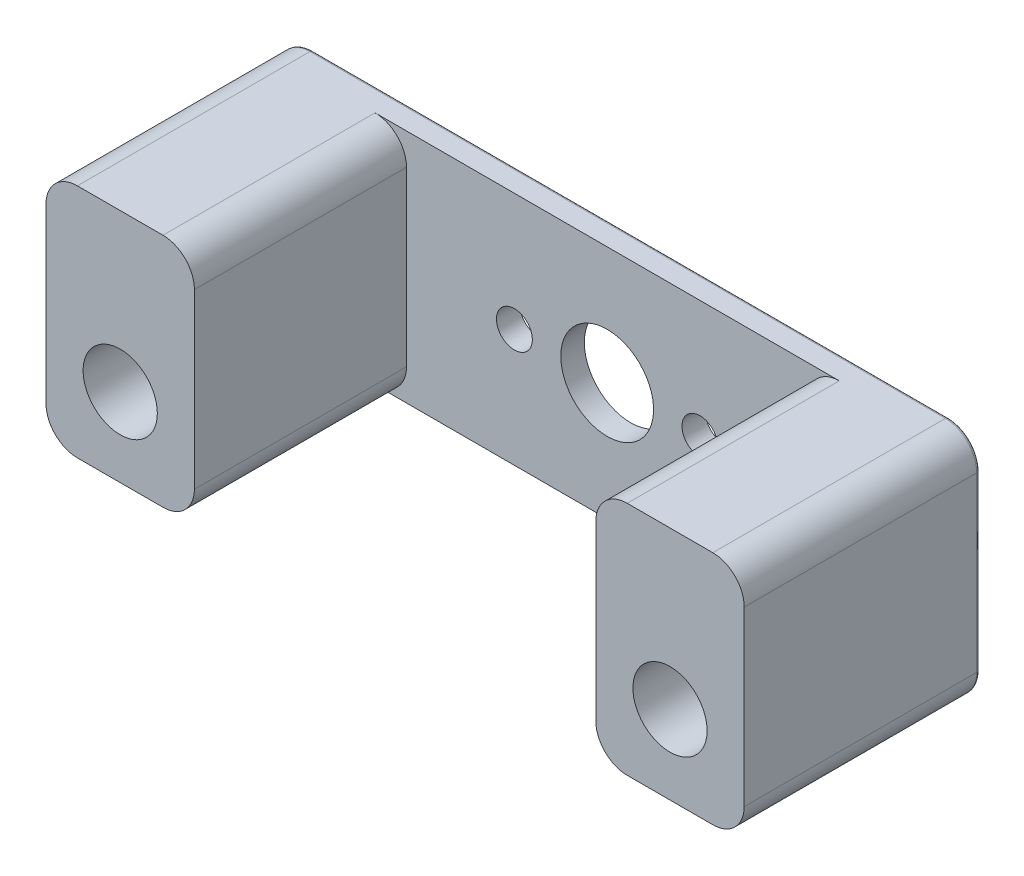
ISO-10303-21;
HEADER;
FILE_DESCRIPTION(('STEP AP214'),'2;1');
FILE_NAME('part.step','',(''),(''),'','','');
FILE_SCHEMA(('AUTOMOTIVE_DESIGN { 1 0 10303 214 1 1 1 1 }'));
ENDSEC;
DATA;
#1=APPLICATION_CONTEXT('core data for automotive mechanical design processes');
#2=APPLICATION_PROTOCOL_DEFINITION('international standard','automotive_design',2000,#1);
#3=PRODUCT_CONTEXT('',#1,'mechanical');
#4=PRODUCT('Part','Part','',(#3));
#5=PRODUCT_RELATED_PRODUCT_CATEGORY('part','',(#4));
#6=PRODUCT_DEFINITION_FORMATION('','',#4);
#7=PRODUCT_DEFINITION_CONTEXT('part definition',#1,'design');
#8=PRODUCT_DEFINITION('design','',#6,#7);
#9=PRODUCT_DEFINITION_SHAPE('','',#8);
#10=(LENGTH_UNIT() NAMED_UNIT(*) SI_UNIT(.MILLI.,.METRE.));
#11=(NAMED_UNIT(*) PLANE_ANGLE_UNIT() SI_UNIT($,.RADIAN.));
#12=(NAMED_UNIT(*) SI_UNIT($,.STERADIAN.) SOLID_ANGLE_UNIT());
#13=UNCERTAINTY_MEASURE_WITH_UNIT(LENGTH_MEASURE(1.E-05),#10,'distance_accuracy_value','');
#14=(GEOMETRIC_REPRESENTATION_CONTEXT(3) GLOBAL_UNCERTAINTY_ASSIGNED_CONTEXT((#13)) GLOBAL_UNIT_ASSIGNED_CONTEXT((#10,
#11,#12)) REPRESENTATION_CONTEXT('',''));
#15=CARTESIAN_POINT('',(0.,0.,0.));
#16=DIRECTION('',(0.,0.,1.));
#17=DIRECTION('',(1.,0.,0.));
#18=AXIS2_PLACEMENT_3D('',#15,#16,#17);
#19=CARTESIAN_POINT('',(0.,9.525,19.05));
#20=DIRECTION('',(0.,1.,0.));
#21=DIRECTION('',(0.,0.,1.));
#22=AXIS2_PLACEMENT_3D('',#19,#20,#21);
#23=PLANE('',#22);
#24=DIRECTION('',(0.,0.,-1.));
#25=VECTOR('',#24,1.);
#26=CARTESIAN_POINT('',(25.68448,9.525,19.05));
#27=LINE('',#26,#25);
#28=CARTESIAN_POINT('',(25.68448,9.525,19.05));
#29=VERTEX_POINT('',#28);
#30=CARTESIAN_POINT('',(25.68448,9.525,0.254000000000001));
#31=VERTEX_POINT('',#30);
#32=EDGE_CURVE('E272',#29,#31,#27,.T.);
#33=ORIENTED_EDGE('',*,*,#32,.T.);
#34=DIRECTION('',(1.,0.,0.));
#35=VECTOR('',#34,1.);
#36=CARTESIAN_POINT('',(-25.68448,9.525,0.254));
#37=LINE('',#36,#35);
#38=CARTESIAN_POINT('',(-25.68448,9.525,0.254000000000001));
#39=VERTEX_POINT('',#38);
#40=EDGE_CURVE('E11',#31,#39,#37,.F.);
#41=ORIENTED_EDGE('',*,*,#40,.T.);
#42=DIRECTION('',(0.,0.,-1.));
#43=VECTOR('',#42,1.);
#44=CARTESIAN_POINT('',(-25.68448,9.525,19.05));
#45=LINE('',#44,#43);
#46=CARTESIAN_POINT('',(-25.68448,9.525,19.05));
#47=VERTEX_POINT('',#46);
#48=EDGE_CURVE('E269',#39,#47,#45,.F.);
#49=ORIENTED_EDGE('',*,*,#48,.T.);
#50=DIRECTION('',(1.,0.,0.));
#51=VECTOR('',#50,1.);
#52=CARTESIAN_POINT('',(0.,9.525,19.05));
#53=LINE('',#52,#51);
#54=CARTESIAN_POINT('',(-18.76552,9.525,19.05));
#55=VERTEX_POINT('',#54);
#56=EDGE_CURVE('E427',#47,#55,#53,.T.);
#57=ORIENTED_EDGE('',*,*,#56,.T.);
#58=DIRECTION('',(0.,0.,1.));
#59=VECTOR('',#58,1.);
#60=CARTESIAN_POINT('',(-18.76552,9.525,1.905));
#61=LINE('',#60,#59);
#62=CARTESIAN_POINT('',(-18.76552,9.525,1.905));
#63=VERTEX_POINT('',#62);
#64=EDGE_CURVE('E275',#55,#63,#61,.F.);
#65=ORIENTED_EDGE('',*,*,#64,.T.);
#66=DIRECTION('',(-1.,0.,0.));
#67=VECTOR('',#66,1.);
#68=CARTESIAN_POINT('',(0.,9.525,1.90499999999999));
#69=LINE('',#68,#67);
#70=CARTESIAN_POINT('',(18.76552,9.525,1.90499999999999));
#71=VERTEX_POINT('',#70);
#72=EDGE_CURVE('E370',#71,#63,#69,.T.);
#73=ORIENTED_EDGE('',*,*,#72,.F.);
#74=DIRECTION('',(0.,0.,1.));
#75=VECTOR('',#74,1.);
#76=CARTESIAN_POINT('',(18.76552,9.525,19.05));
#77=LINE('',#76,#75);
#78=CARTESIAN_POINT('',(18.76552,9.525,19.05));
#79=VERTEX_POINT('',#78);
#80=EDGE_CURVE('E279',#71,#79,#77,.T.);
#81=ORIENTED_EDGE('',*,*,#80,.T.);
#82=EDGE_CURVE('E422',#79,#29,#53,.T.);
#83=ORIENTED_EDGE('',*,*,#82,.T.);
#84=EDGE_LOOP('',(#33,#41,#49,#57,#65,#73,#81,#83));
#85=FACE_BOUND('',#84,.T.);
#86=ADVANCED_FACE('F45',(#85),#23,.T.);
#87=CARTESIAN_POINT('',(0.,-9.525,19.05));
#88=DIRECTION('',(0.,1.,0.));
#89=DIRECTION('',(0.,0.,1.));
#90=AXIS2_PLACEMENT_3D('',#87,#88,#89);
#91=PLANE('',#90);
#92=DIRECTION('',(0.,0.,-1.));
#93=VECTOR('',#92,1.);
#94=CARTESIAN_POINT('',(-25.68448,-9.525,19.05));
#95=LINE('',#94,#93);
#96=CARTESIAN_POINT('',(-25.68448,-9.525,19.05));
#97=VERTEX_POINT('',#96);
#98=CARTESIAN_POINT('',(-25.68448,-9.525,0.254000000000001));
#99=VERTEX_POINT('',#98);
#100=EDGE_CURVE('E204',#97,#99,#95,.T.);
#101=ORIENTED_EDGE('',*,*,#100,.T.);
#102=DIRECTION('',(1.,0.,0.));
#103=VECTOR('',#102,1.);
#104=CARTESIAN_POINT('',(0.,-9.525,0.254000000000001));
#105=LINE('',#104,#103);
#106=CARTESIAN_POINT('',(25.68448,-9.525,0.254000000000001));
#107=VERTEX_POINT('',#106);
#108=EDGE_CURVE('E331',#99,#107,#105,.T.);
#109=ORIENTED_EDGE('',*,*,#108,.T.);
#110=DIRECTION('',(0.,0.,-1.));
#111=VECTOR('',#110,1.);
#112=CARTESIAN_POINT('',(25.68448,-9.525,19.05));
#113=LINE('',#112,#111);
#114=CARTESIAN_POINT('',(25.68448,-9.525,19.05));
#115=VERTEX_POINT('',#114);
#116=EDGE_CURVE('E217',#107,#115,#113,.F.);
#117=ORIENTED_EDGE('',*,*,#116,.T.);
#118=DIRECTION('',(1.,0.,0.));
#119=VECTOR('',#118,1.);
#120=CARTESIAN_POINT('',(0.,-9.525,19.05));
#121=LINE('',#120,#119);
#122=CARTESIAN_POINT('',(18.76552,-9.525,19.05));
#123=VERTEX_POINT('',#122);
#124=EDGE_CURVE('E210',#123,#115,#121,.T.);
#125=ORIENTED_EDGE('',*,*,#124,.F.);
#126=DIRECTION('',(0.,0.,-1.));
#127=VECTOR('',#126,1.);
#128=CARTESIAN_POINT('',(18.76552,-9.525,1.90499999999999));
#129=LINE('',#128,#127);
#130=CARTESIAN_POINT('',(18.76552,-9.52500000000001,1.90499999999999));
#131=VERTEX_POINT('',#130);
#132=EDGE_CURVE('E224',#123,#131,#129,.T.);
#133=ORIENTED_EDGE('',*,*,#132,.T.);
#134=DIRECTION('',(1.,0.,0.));
#135=VECTOR('',#134,1.);
#136=CARTESIAN_POINT('',(0.,-9.52500000000001,1.90499999999999));
#137=LINE('',#136,#135);
#138=CARTESIAN_POINT('',(-18.76552,-9.525,1.905));
#139=VERTEX_POINT('',#138);
#140=EDGE_CURVE('E384',#139,#131,#137,.T.);
#141=ORIENTED_EDGE('',*,*,#140,.F.);
#142=DIRECTION('',(0.,0.,-1.));
#143=VECTOR('',#142,1.);
#144=CARTESIAN_POINT('',(-18.76552,-9.525,19.05));
#145=LINE('',#144,#143);
#146=CARTESIAN_POINT('',(-18.76552,-9.525,19.05));
#147=VERTEX_POINT('',#146);
#148=EDGE_CURVE('E207',#139,#147,#145,.F.);
#149=ORIENTED_EDGE('',*,*,#148,.T.);
#150=EDGE_CURVE('E190',#97,#147,#121,.T.);
#151=ORIENTED_EDGE('',*,*,#150,.F.);
#152=EDGE_LOOP('',(#101,#109,#117,#125,#133,#141,#149,#151));
#153=FACE_BOUND('',#152,.T.);
#154=ADVANCED_FACE('F203',(#153),#91,.F.);
#155=CARTESIAN_POINT('',(0.,0.,19.05));
#156=DIRECTION('',(0.,0.,1.));
#157=DIRECTION('',(1.,0.,0.));
#158=AXIS2_PLACEMENT_3D('',#155,#156,#157);
#159=PLANE('',#158);
#160=CARTESIAN_POINT('',(22.225,-3.175,19.05));
#161=DIRECTION('',(0.,0.,1.));
#162=DIRECTION('',(1.,0.,0.));
#163=AXIS2_PLACEMENT_3D('',#160,#161,#162);
#164=CIRCLE('',#163,2.99974);
#165=CARTESIAN_POINT('',(25.22474,-3.175,19.05));
#166=VERTEX_POINT('',#165);
#167=EDGE_CURVE('E435',#166,#166,#164,.F.);
#168=ORIENTED_EDGE('',*,*,#167,.T.);
#169=EDGE_LOOP('',(#168));
#170=FACE_BOUND('',#169,.T.);
#171=ORIENTED_EDGE('',*,*,#124,.T.);
#172=CARTESIAN_POINT('',(25.68448,-6.985,19.05));
#173=DIRECTION('',(0.,0.,1.));
#174=DIRECTION('',(1.,0.,0.));
#175=AXIS2_PLACEMENT_3D('',#172,#173,#174);
#176=CIRCLE('',#175,2.54);
#177=CARTESIAN_POINT('',(28.22448,-6.985,19.05));
#178=VERTEX_POINT('',#177);
#179=EDGE_CURVE('E252',#115,#178,#176,.T.);
#180=ORIENTED_EDGE('',*,*,#179,.T.);
#181=DIRECTION('',(0.,-1.,0.));
#182=VECTOR('',#181,1.);
#183=CARTESIAN_POINT('',(28.22448,0.,19.05));
#184=LINE('',#183,#182);
#185=CARTESIAN_POINT('',(28.22448,6.985,19.05));
#186=VERTEX_POINT('',#185);
#187=EDGE_CURVE('E418',#186,#178,#184,.T.);
#188=ORIENTED_EDGE('',*,*,#187,.F.);
#189=CARTESIAN_POINT('',(25.68448,6.985,19.05));
#190=DIRECTION('',(0.,0.,1.));
#191=DIRECTION('',(1.,0.,0.));
#192=AXIS2_PLACEMENT_3D('',#189,#190,#191);
#193=CIRCLE('',#192,2.54);
#194=EDGE_CURVE('E243',#186,#29,#193,.T.);
#195=ORIENTED_EDGE('',*,*,#194,.T.);
#196=ORIENTED_EDGE('',*,*,#82,.F.);
#197=CARTESIAN_POINT('',(18.76552,6.985,19.05));
#198=DIRECTION('',(0.,0.,1.));
#199=DIRECTION('',(1.,0.,0.));
#200=AXIS2_PLACEMENT_3D('',#197,#198,#199);
#201=CIRCLE('',#200,2.54);
#202=CARTESIAN_POINT('',(16.22552,6.985,19.05));
#203=VERTEX_POINT('',#202);
#204=EDGE_CURVE('E246',#79,#203,#201,.T.);
#205=ORIENTED_EDGE('',*,*,#204,.T.);
#206=DIRECTION('',(0.,1.,0.));
#207=VECTOR('',#206,1.);
#208=CARTESIAN_POINT('',(16.22552,-46.2267849985747,19.05));
#209=LINE('',#208,#207);
#210=CARTESIAN_POINT('',(16.22552,-6.985,19.05));
#211=VERTEX_POINT('',#210);
#212=EDGE_CURVE('E389',#211,#203,#209,.T.);
#213=ORIENTED_EDGE('',*,*,#212,.F.);
#214=CARTESIAN_POINT('',(18.76552,-6.985,19.05));
#215=DIRECTION('',(0.,0.,1.));
#216=DIRECTION('',(1.,0.,0.));
#217=AXIS2_PLACEMENT_3D('',#214,#215,#216);
#218=CIRCLE('',#217,2.54);
#219=EDGE_CURVE('E249',#211,#123,#218,.T.);
#220=ORIENTED_EDGE('',*,*,#219,.T.);
#221=EDGE_LOOP('',(#171,#180,#188,#195,#196,#205,#213,#220));
#222=FACE_BOUND('',#221,.T.);
#223=ADVANCED_FACE('F472',(#170,#222),#159,.T.);
#224=CARTESIAN_POINT('',(28.22448,0.,19.05));
#225=DIRECTION('',(1.,0.,0.));
#226=DIRECTION('',(0.,0.,-1.));
#227=AXIS2_PLACEMENT_3D('',#224,#225,#226);
#228=PLANE('',#227);
#229=DIRECTION('',(0.,0.,-1.));
#230=VECTOR('',#229,1.);
#231=CARTESIAN_POINT('',(28.22448,-6.985,0.));
#232=LINE('',#231,#230);
#233=CARTESIAN_POINT('',(28.22448,-6.985,0.254));
#234=VERTEX_POINT('',#233);
#235=EDGE_CURVE('E240',#178,#234,#232,.T.);
#236=ORIENTED_EDGE('',*,*,#235,.T.);
#237=DIRECTION('',(0.,-1.,0.));
#238=VECTOR('',#237,1.);
#239=CARTESIAN_POINT('',(28.22448,6.985,0.254));
#240=LINE('',#239,#238);
#241=CARTESIAN_POINT('',(28.22448,6.985,0.254000000000001));
#242=VERTEX_POINT('',#241);
#243=EDGE_CURVE('E70',#234,#242,#240,.F.);
#244=ORIENTED_EDGE('',*,*,#243,.T.);
#245=DIRECTION('',(0.,0.,-1.));
#246=VECTOR('',#245,1.);
#247=CARTESIAN_POINT('',(28.22448,6.985,19.05));
#248=LINE('',#247,#246);
#249=EDGE_CURVE('E198',#242,#186,#248,.F.);
#250=ORIENTED_EDGE('',*,*,#249,.T.);
#251=ORIENTED_EDGE('',*,*,#187,.T.);
#252=EDGE_LOOP('',(#236,#244,#250,#251));
#253=FACE_BOUND('',#252,.T.);
#254=ADVANCED_FACE('F535',(#253),#228,.T.);
#255=CARTESIAN_POINT('',(-28.22448,0.,19.05));
#256=DIRECTION('',(1.,0.,0.));
#257=DIRECTION('',(0.,0.,-1.));
#258=AXIS2_PLACEMENT_3D('',#255,#256,#257);
#259=PLANE('',#258);
#260=DIRECTION('',(0.,0.,-1.));
#261=VECTOR('',#260,1.);
#262=CARTESIAN_POINT('',(-28.22448,6.985,0.));
#263=LINE('',#262,#261);
#264=CARTESIAN_POINT('',(-28.22448,6.985,19.05));
#265=VERTEX_POINT('',#264);
#266=CARTESIAN_POINT('',(-28.22448,6.985,0.254000000000001));
#267=VERTEX_POINT('',#266);
#268=EDGE_CURVE('E216',#265,#267,#263,.T.);
#269=ORIENTED_EDGE('',*,*,#268,.T.);
#270=DIRECTION('',(0.,-1.,0.));
#271=VECTOR('',#270,1.);
#272=CARTESIAN_POINT('',(-28.22448,0.,0.254000000000001));
#273=LINE('',#272,#271);
#274=CARTESIAN_POINT('',(-28.22448,-6.985,0.254000000000001));
#275=VERTEX_POINT('',#274);
#276=EDGE_CURVE('E326',#267,#275,#273,.T.);
#277=ORIENTED_EDGE('',*,*,#276,.T.);
#278=DIRECTION('',(0.,0.,-1.));
#279=VECTOR('',#278,1.);
#280=CARTESIAN_POINT('',(-28.22448,-6.985,19.05));
#281=LINE('',#280,#279);
#282=CARTESIAN_POINT('',(-28.22448,-6.985,19.05));
#283=VERTEX_POINT('',#282);
#284=EDGE_CURVE('E222',#275,#283,#281,.F.);
#285=ORIENTED_EDGE('',*,*,#284,.T.);
#286=DIRECTION('',(0.,-1.,0.));
#287=VECTOR('',#286,1.);
#288=CARTESIAN_POINT('',(-28.22448,0.,19.05));
#289=LINE('',#288,#287);
#290=EDGE_CURVE('E193',#265,#283,#289,.T.);
#291=ORIENTED_EDGE('',*,*,#290,.F.);
#292=EDGE_LOOP('',(#269,#277,#285,#291));
#293=FACE_BOUND('',#292,.T.);
#294=ADVANCED_FACE('F498',(#293),#259,.F.);
#295=CARTESIAN_POINT('',(-22.225,-3.175,19.05));
#296=DIRECTION('',(0.,0.,-1.));
#297=DIRECTION('',(-1.,0.,0.));
#298=AXIS2_PLACEMENT_3D('',#295,#296,#297);
#299=CYLINDRICAL_SURFACE('',#298,2.99974);
#300=CARTESIAN_POINT('',(-22.225,-3.175,19.05));
#301=DIRECTION('',(0.,0.,1.));
#302=DIRECTION('',(1.,0.,0.));
#303=AXIS2_PLACEMENT_3D('',#300,#301,#302);
#304=CIRCLE('',#303,2.99974);
#305=CARTESIAN_POINT('',(-19.22526,-3.175,19.05));
#306=VERTEX_POINT('',#305);
#307=EDGE_CURVE('E209',#306,#306,#304,.T.);
#308=ORIENTED_EDGE('',*,*,#307,.T.);
#309=EDGE_LOOP('',(#308));
#310=FACE_BOUND('',#309,.T.);
#311=CARTESIAN_POINT('',(-22.225,-3.175,0.));
#312=DIRECTION('',(0.,0.,1.));
#313=DIRECTION('',(1.,0.,0.));
#314=AXIS2_PLACEMENT_3D('',#311,#312,#313);
#315=CIRCLE('',#314,2.99974);
#316=CARTESIAN_POINT('',(-19.22526,-3.175,0.));
#317=VERTEX_POINT('',#316);
#318=EDGE_CURVE('E417',#317,#317,#315,.T.);
#319=ORIENTED_EDGE('',*,*,#318,.F.);
#320=EDGE_LOOP('',(#319));
#321=FACE_BOUND('',#320,.T.);
#322=ADVANCED_FACE('F793',(#310,#321),#299,.F.);
#323=CARTESIAN_POINT('',(22.225,-3.175,19.05));
#324=DIRECTION('',(0.,0.,-1.));
#325=DIRECTION('',(-1.,0.,0.));
#326=AXIS2_PLACEMENT_3D('',#323,#324,#325);
#327=CYLINDRICAL_SURFACE('',#326,2.99974);
#328=ORIENTED_EDGE('',*,*,#167,.F.);
#329=EDGE_LOOP('',(#328));
#330=FACE_BOUND('',#329,.T.);
#331=CARTESIAN_POINT('',(22.225,-3.175,0.));
#332=DIRECTION('',(0.,0.,1.));
#333=DIRECTION('',(1.,0.,0.));
#334=AXIS2_PLACEMENT_3D('',#331,#332,#333);
#335=CIRCLE('',#334,2.99974);
#336=CARTESIAN_POINT('',(25.22474,-3.175,0.));
#337=VERTEX_POINT('',#336);
#338=EDGE_CURVE('E423',#337,#337,#335,.F.);
#339=ORIENTED_EDGE('',*,*,#338,.T.);
#340=EDGE_LOOP('',(#339));
#341=FACE_BOUND('',#340,.T.);
#342=ADVANCED_FACE('F785',(#330,#341),#327,.F.);
#343=ORIENTED_EDGE('',*,*,#290,.T.);
#344=CARTESIAN_POINT('',(-25.68448,-6.985,19.05));
#345=DIRECTION('',(0.,0.,1.));
#346=DIRECTION('',(1.,0.,0.));
#347=AXIS2_PLACEMENT_3D('',#344,#345,#346);
#348=CIRCLE('',#347,2.54);
#349=EDGE_CURVE('E186',#283,#97,#348,.T.);
#350=ORIENTED_EDGE('',*,*,#349,.T.);
#351=ORIENTED_EDGE('',*,*,#150,.T.);
#352=CARTESIAN_POINT('',(-18.76552,-6.985,19.05));
#353=DIRECTION('',(0.,0.,1.));
#354=DIRECTION('',(1.,0.,0.));
#355=AXIS2_PLACEMENT_3D('',#352,#353,#354);
#356=CIRCLE('',#355,2.54);
#357=CARTESIAN_POINT('',(-16.22552,-6.985,19.05));
#358=VERTEX_POINT('',#357);
#359=EDGE_CURVE('E199',#147,#358,#356,.T.);
#360=ORIENTED_EDGE('',*,*,#359,.T.);
#361=DIRECTION('',(0.,1.,0.));
#362=VECTOR('',#361,1.);
#363=CARTESIAN_POINT('',(-16.22552,-46.2267849985747,19.05));
#364=LINE('',#363,#362);
#365=CARTESIAN_POINT('',(-16.22552,6.985,19.05));
#366=VERTEX_POINT('',#365);
#367=EDGE_CURVE('E380',#358,#366,#364,.T.);
#368=ORIENTED_EDGE('',*,*,#367,.T.);
#369=CARTESIAN_POINT('',(-18.76552,6.985,19.05));
#370=DIRECTION('',(0.,0.,1.));
#371=DIRECTION('',(1.,0.,0.));
#372=AXIS2_PLACEMENT_3D('',#369,#370,#371);
#373=CIRCLE('',#372,2.54);
#374=EDGE_CURVE('E233',#366,#55,#373,.T.);
#375=ORIENTED_EDGE('',*,*,#374,.T.);
#376=ORIENTED_EDGE('',*,*,#56,.F.);
#377=CARTESIAN_POINT('',(-25.68448,6.985,19.05));
#378=DIRECTION('',(0.,0.,1.));
#379=DIRECTION('',(1.,0.,0.));
#380=AXIS2_PLACEMENT_3D('',#377,#378,#379);
#381=CIRCLE('',#380,2.54);
#382=EDGE_CURVE('E230',#47,#265,#381,.T.);
#383=ORIENTED_EDGE('',*,*,#382,.T.);
#384=EDGE_LOOP('',(#343,#350,#351,#360,#368,#375,#376,#383));
#385=FACE_BOUND('',#384,.T.);
#386=ORIENTED_EDGE('',*,*,#307,.F.);
#387=EDGE_LOOP('',(#386));
#388=FACE_BOUND('',#387,.T.);
#389=ADVANCED_FACE('F188',(#385,#388),#159,.T.);
#390=CARTESIAN_POINT('',(0.,0.,0.));
#391=DIRECTION('',(0.,0.,1.));
#392=DIRECTION('',(1.,0.,0.));
#393=AXIS2_PLACEMENT_3D('',#390,#391,#392);
#394=PLANE('',#393);
#395=DIRECTION('',(0.,-1.,0.));
#396=VECTOR('',#395,1.);
#397=CARTESIAN_POINT('',(-27.97048,0.,0.));
#398=LINE('',#397,#396);
#399=CARTESIAN_POINT('',(-27.97048,-6.985,0.));
#400=VERTEX_POINT('',#399);
#401=CARTESIAN_POINT('',(-27.97048,6.985,0.));
#402=VERTEX_POINT('',#401);
#403=EDGE_CURVE('E315',#400,#402,#398,.F.);
#404=ORIENTED_EDGE('',*,*,#403,.T.);
#405=CARTESIAN_POINT('',(-25.68448,6.985,0.));
#406=DIRECTION('',(0.,0.,1.));
#407=DIRECTION('',(1.,0.,0.));
#408=AXIS2_PLACEMENT_3D('',#405,#406,#407);
#409=CIRCLE('',#408,2.286);
#410=CARTESIAN_POINT('',(-25.68448,9.271,0.));
#411=VERTEX_POINT('',#410);
#412=EDGE_CURVE('E318',#402,#411,#409,.F.);
#413=ORIENTED_EDGE('',*,*,#412,.T.);
#414=DIRECTION('',(1.,0.,0.));
#415=VECTOR('',#414,1.);
#416=CARTESIAN_POINT('',(25.68448,9.271,0.));
#417=LINE('',#416,#415);
#418=CARTESIAN_POINT('',(25.68448,9.271,0.));
#419=VERTEX_POINT('',#418);
#420=EDGE_CURVE('E297',#411,#419,#417,.T.);
#421=ORIENTED_EDGE('',*,*,#420,.T.);
#422=CARTESIAN_POINT('',(25.68448,6.985,0.));
#423=DIRECTION('',(0.,0.,1.));
#424=DIRECTION('',(1.,0.,0.));
#425=AXIS2_PLACEMENT_3D('',#422,#423,#424);
#426=CIRCLE('',#425,2.286);
#427=CARTESIAN_POINT('',(27.97048,6.985,0.));
#428=VERTEX_POINT('',#427);
#429=EDGE_CURVE('E300',#419,#428,#426,.F.);
#430=ORIENTED_EDGE('',*,*,#429,.T.);
#431=DIRECTION('',(0.,-1.,0.));
#432=VECTOR('',#431,1.);
#433=CARTESIAN_POINT('',(27.97048,-6.985,0.));
#434=LINE('',#433,#432);
#435=CARTESIAN_POINT('',(27.97048,-6.985,0.));
#436=VERTEX_POINT('',#435);
#437=EDGE_CURVE('E303',#428,#436,#434,.T.);
#438=ORIENTED_EDGE('',*,*,#437,.T.);
#439=CARTESIAN_POINT('',(25.68448,-6.985,0.));
#440=DIRECTION('',(0.,0.,1.));
#441=DIRECTION('',(1.,0.,0.));
#442=AXIS2_PLACEMENT_3D('',#439,#440,#441);
#443=CIRCLE('',#442,2.286);
#444=CARTESIAN_POINT('',(25.68448,-9.271,0.));
#445=VERTEX_POINT('',#444);
#446=EDGE_CURVE('E306',#436,#445,#443,.F.);
#447=ORIENTED_EDGE('',*,*,#446,.T.);
#448=DIRECTION('',(1.,0.,0.));
#449=VECTOR('',#448,1.);
#450=CARTESIAN_POINT('',(0.,-9.271,0.));
#451=LINE('',#450,#449);
#452=CARTESIAN_POINT('',(-25.68448,-9.271,0.));
#453=VERTEX_POINT('',#452);
#454=EDGE_CURVE('E309',#445,#453,#451,.F.);
#455=ORIENTED_EDGE('',*,*,#454,.T.);
#456=CARTESIAN_POINT('',(-25.68448,-6.985,0.));
#457=DIRECTION('',(0.,0.,1.));
#458=DIRECTION('',(1.,0.,0.));
#459=AXIS2_PLACEMENT_3D('',#456,#457,#458);
#460=CIRCLE('',#459,2.286);
#461=EDGE_CURVE('E312',#453,#400,#460,.F.);
#462=ORIENTED_EDGE('',*,*,#461,.T.);
#463=EDGE_LOOP('',(#404,#413,#421,#430,#438,#447,#455,#462));
#464=FACE_BOUND('',#463,.T.);
#465=CARTESIAN_POINT('',(7.5,0.,0.));
#466=DIRECTION('',(0.,0.,-1.));
#467=DIRECTION('',(-1.,0.,0.));
#468=AXIS2_PLACEMENT_3D('',#465,#466,#467);
#469=CIRCLE('',#468,1.44999999999998);
#470=CARTESIAN_POINT('',(6.05000000000002,0.,0.));
#471=VERTEX_POINT('',#470);
#472=EDGE_CURVE('E405',#471,#471,#469,.T.);
#473=ORIENTED_EDGE('',*,*,#472,.F.);
#474=EDGE_LOOP('',(#473));
#475=FACE_BOUND('',#474,.T.);
#476=CARTESIAN_POINT('',(-7.5,0.,0.));
#477=DIRECTION('',(0.,0.,-1.));
#478=DIRECTION('',(-1.,0.,0.));
#479=AXIS2_PLACEMENT_3D('',#476,#477,#478);
#480=CIRCLE('',#479,1.44999999999998);
#481=CARTESIAN_POINT('',(-8.94999999999998,0.,0.));
#482=VERTEX_POINT('',#481);
#483=EDGE_CURVE('E406',#482,#482,#480,.T.);
#484=ORIENTED_EDGE('',*,*,#483,.F.);
#485=EDGE_LOOP('',(#484));
#486=FACE_BOUND('',#485,.T.);
#487=CARTESIAN_POINT('',(0.,0.,0.));
#488=DIRECTION('',(0.,0.,-1.));
#489=DIRECTION('',(-1.,0.,0.));
#490=AXIS2_PLACEMENT_3D('',#487,#488,#489);
#491=CIRCLE('',#490,3.74999999999999);
#492=CARTESIAN_POINT('',(-3.74999999999999,0.,0.));
#493=VERTEX_POINT('',#492);
#494=EDGE_CURVE('E410',#493,#493,#491,.T.);
#495=ORIENTED_EDGE('',*,*,#494,.F.);
#496=EDGE_LOOP('',(#495));
#497=FACE_BOUND('',#496,.T.);
#498=ORIENTED_EDGE('',*,*,#318,.T.);
#499=EDGE_LOOP('',(#498));
#500=FACE_BOUND('',#499,.T.);
#501=ORIENTED_EDGE('',*,*,#338,.F.);
#502=EDGE_LOOP('',(#501));
#503=FACE_BOUND('',#502,.T.);
#504=ADVANCED_FACE('F508',(#464,#475,#486,#497,#500,#503),#394,.F.);
#505=CARTESIAN_POINT('',(0.,0.,29.6566017177982));
#506=DIRECTION('',(0.,0.,-1.));
#507=DIRECTION('',(-1.,0.,0.));
#508=AXIS2_PLACEMENT_3D('',#505,#506,#507);
#509=CYLINDRICAL_SURFACE('',#508,3.74999999999999);
#510=CARTESIAN_POINT('',(0.,0.,1.90499999999999));
#511=DIRECTION('',(0.,0.,-1.));
#512=DIRECTION('',(-1.,0.,0.));
#513=AXIS2_PLACEMENT_3D('',#510,#511,#512);
#514=CIRCLE('',#513,3.74999999999999);
#515=CARTESIAN_POINT('',(-3.74999999999999,0.,1.90499999999999));
#516=VERTEX_POINT('',#515);
#517=EDGE_CURVE('E400',#516,#516,#514,.F.);
#518=ORIENTED_EDGE('',*,*,#517,.T.);
#519=EDGE_LOOP('',(#518));
#520=FACE_BOUND('',#519,.T.);
#521=ORIENTED_EDGE('',*,*,#494,.T.);
#522=EDGE_LOOP('',(#521));
#523=FACE_BOUND('',#522,.T.);
#524=ADVANCED_FACE('F756',(#520,#523),#509,.F.);
#525=CARTESIAN_POINT('',(-7.5,0.,29.6566017177982));
#526=DIRECTION('',(0.,0.,-1.));
#527=DIRECTION('',(-1.,0.,0.));
#528=AXIS2_PLACEMENT_3D('',#525,#526,#527);
#529=CYLINDRICAL_SURFACE('',#528,1.44999999999998);
#530=CARTESIAN_POINT('',(-7.5,0.,1.90499999999999));
#531=DIRECTION('',(0.,0.,-1.));
#532=DIRECTION('',(-1.,0.,0.));
#533=AXIS2_PLACEMENT_3D('',#530,#531,#532);
#534=CIRCLE('',#533,1.44999999999998);
#535=CARTESIAN_POINT('',(-8.94999999999998,0.,1.90499999999999));
#536=VERTEX_POINT('',#535);
#537=EDGE_CURVE('E396',#536,#536,#534,.F.);
#538=ORIENTED_EDGE('',*,*,#537,.T.);
#539=EDGE_LOOP('',(#538));
#540=FACE_BOUND('',#539,.T.);
#541=ORIENTED_EDGE('',*,*,#483,.T.);
#542=EDGE_LOOP('',(#541));
#543=FACE_BOUND('',#542,.T.);
#544=ADVANCED_FACE('F746',(#540,#543),#529,.F.);
#545=CARTESIAN_POINT('',(7.5,0.,29.6566017177982));
#546=DIRECTION('',(0.,0.,-1.));
#547=DIRECTION('',(-1.,0.,0.));
#548=AXIS2_PLACEMENT_3D('',#545,#546,#547);
#549=CYLINDRICAL_SURFACE('',#548,1.44999999999998);
#550=CARTESIAN_POINT('',(7.5,0.,1.90499999999999));
#551=DIRECTION('',(0.,0.,-1.));
#552=DIRECTION('',(-1.,0.,0.));
#553=AXIS2_PLACEMENT_3D('',#550,#551,#552);
#554=CIRCLE('',#553,1.44999999999998);
#555=CARTESIAN_POINT('',(6.05000000000002,0.,1.90499999999999));
#556=VERTEX_POINT('',#555);
#557=EDGE_CURVE('E401',#556,#556,#554,.F.);
#558=ORIENTED_EDGE('',*,*,#557,.T.);
#559=EDGE_LOOP('',(#558));
#560=FACE_BOUND('',#559,.T.);
#561=ORIENTED_EDGE('',*,*,#472,.T.);
#562=EDGE_LOOP('',(#561));
#563=FACE_BOUND('',#562,.T.);
#564=ADVANCED_FACE('F710',(#560,#563),#549,.F.);
#565=CARTESIAN_POINT('',(0.,-46.2267849985747,1.90499999999999));
#566=DIRECTION('',(0.,0.,-1.));
#567=DIRECTION('',(-1.,0.,0.));
#568=AXIS2_PLACEMENT_3D('',#565,#566,#567);
#569=PLANE('',#568);
#570=ORIENTED_EDGE('',*,*,#537,.F.);
#571=EDGE_LOOP('',(#570));
#572=FACE_BOUND('',#571,.T.);
#573=ORIENTED_EDGE('',*,*,#140,.T.);
#574=CARTESIAN_POINT('',(18.76552,-6.985,1.90499999999999));
#575=DIRECTION('',(0.,0.,-1.));
#576=DIRECTION('',(-1.,0.,0.));
#577=AXIS2_PLACEMENT_3D('',#574,#575,#576);
#578=CIRCLE('',#577,2.54);
#579=CARTESIAN_POINT('',(16.22552,-6.985,1.90499999999999));
#580=VERTEX_POINT('',#579);
#581=EDGE_CURVE('E283',#131,#580,#578,.T.);
#582=ORIENTED_EDGE('',*,*,#581,.T.);
#583=DIRECTION('',(0.,1.,0.));
#584=VECTOR('',#583,1.);
#585=CARTESIAN_POINT('',(16.22552,-46.2267849985747,1.90499999999999));
#586=LINE('',#585,#584);
#587=CARTESIAN_POINT('',(16.22552,6.985,1.90499999999999));
#588=VERTEX_POINT('',#587);
#589=EDGE_CURVE('E385',#580,#588,#586,.T.);
#590=ORIENTED_EDGE('',*,*,#589,.T.);
#591=CARTESIAN_POINT('',(18.76552,6.985,1.90499999999999));
#592=DIRECTION('',(0.,0.,-1.));
#593=DIRECTION('',(-1.,0.,0.));
#594=AXIS2_PLACEMENT_3D('',#591,#592,#593);
#595=CIRCLE('',#594,2.54);
#596=EDGE_CURVE('E290',#588,#71,#595,.T.);
#597=ORIENTED_EDGE('',*,*,#596,.T.);
#598=ORIENTED_EDGE('',*,*,#72,.T.);
#599=CARTESIAN_POINT('',(-18.76552,6.985,1.905));
#600=DIRECTION('',(0.,0.,-1.));
#601=DIRECTION('',(-1.,0.,0.));
#602=AXIS2_PLACEMENT_3D('',#599,#600,#601);
#603=CIRCLE('',#602,2.54);
#604=CARTESIAN_POINT('',(-16.22552,6.985,1.905));
#605=VERTEX_POINT('',#604);
#606=EDGE_CURVE('E294',#63,#605,#603,.T.);
#607=ORIENTED_EDGE('',*,*,#606,.T.);
#608=DIRECTION('',(0.,1.,0.));
#609=VECTOR('',#608,1.);
#610=CARTESIAN_POINT('',(-16.22552,-46.2267849985747,1.905));
#611=LINE('',#610,#609);
#612=CARTESIAN_POINT('',(-16.22552,-6.985,1.905));
#613=VERTEX_POINT('',#612);
#614=EDGE_CURVE('E375',#613,#605,#611,.T.);
#615=ORIENTED_EDGE('',*,*,#614,.F.);
#616=CARTESIAN_POINT('',(-18.76552,-6.985,1.905));
#617=DIRECTION('',(0.,0.,-1.));
#618=DIRECTION('',(-1.,0.,0.));
#619=AXIS2_PLACEMENT_3D('',#616,#617,#618);
#620=CIRCLE('',#619,2.54);
#621=EDGE_CURVE('E286',#613,#139,#620,.T.);
#622=ORIENTED_EDGE('',*,*,#621,.T.);
#623=EDGE_LOOP('',(#573,#582,#590,#597,#598,#607,#615,#622));
#624=FACE_BOUND('',#623,.T.);
#625=ORIENTED_EDGE('',*,*,#557,.F.);
#626=EDGE_LOOP('',(#625));
#627=FACE_BOUND('',#626,.T.);
#628=ORIENTED_EDGE('',*,*,#517,.F.);
#629=EDGE_LOOP('',(#628));
#630=FACE_BOUND('',#629,.T.);
#631=ADVANCED_FACE('F459',(#572,#624,#627,#630),#569,.F.);
#632=CARTESIAN_POINT('',(16.22552,-46.2267849985747,0.));
#633=DIRECTION('',(-1.,0.,0.));
#634=DIRECTION('',(0.,0.,1.));
#635=AXIS2_PLACEMENT_3D('',#632,#633,#634);
#636=PLANE('',#635);
#637=ORIENTED_EDGE('',*,*,#589,.F.);
#638=DIRECTION('',(0.,0.,-1.));
#639=VECTOR('',#638,1.);
#640=CARTESIAN_POINT('',(16.22552,-6.985,19.05));
#641=LINE('',#640,#639);
#642=EDGE_CURVE('E258',#580,#211,#641,.F.);
#643=ORIENTED_EDGE('',*,*,#642,.T.);
#644=ORIENTED_EDGE('',*,*,#212,.T.);
#645=DIRECTION('',(0.,0.,1.));
#646=VECTOR('',#645,1.);
#647=CARTESIAN_POINT('',(16.22552,6.985,0.));
#648=LINE('',#647,#646);
#649=EDGE_CURVE('E255',#203,#588,#648,.F.);
#650=ORIENTED_EDGE('',*,*,#649,.T.);
#651=EDGE_LOOP('',(#637,#643,#644,#650));
#652=FACE_BOUND('',#651,.T.);
#653=ADVANCED_FACE('F463',(#652),#636,.T.);
#654=CARTESIAN_POINT('',(-16.22552,-46.2267849985747,0.));
#655=DIRECTION('',(-1.,0.,0.));
#656=DIRECTION('',(0.,0.,1.));
#657=AXIS2_PLACEMENT_3D('',#654,#655,#656);
#658=PLANE('',#657);
#659=ORIENTED_EDGE('',*,*,#367,.F.);
#660=DIRECTION('',(0.,0.,-1.));
#661=VECTOR('',#660,1.);
#662=CARTESIAN_POINT('',(-16.22552,-6.985,0.));
#663=LINE('',#662,#661);
#664=EDGE_CURVE('E265',#358,#613,#663,.T.);
#665=ORIENTED_EDGE('',*,*,#664,.T.);
#666=ORIENTED_EDGE('',*,*,#614,.T.);
#667=DIRECTION('',(0.,0.,1.));
#668=VECTOR('',#667,1.);
#669=CARTESIAN_POINT('',(-16.22552,6.985,19.05));
#670=LINE('',#669,#668);
#671=EDGE_CURVE('E261',#605,#366,#670,.T.);
#672=ORIENTED_EDGE('',*,*,#671,.T.);
#673=EDGE_LOOP('',(#659,#665,#666,#672));
#674=FACE_BOUND('',#673,.T.);
#675=ADVANCED_FACE('F540',(#674),#658,.F.);
#676=CARTESIAN_POINT('',(-25.68448,-6.985,19.05));
#677=DIRECTION('',(0.,0.,-1.));
#678=DIRECTION('',(-1.,0.,0.));
#679=AXIS2_PLACEMENT_3D('',#676,#677,#678);
#680=CYLINDRICAL_SURFACE('',#679,2.54);
#681=ORIENTED_EDGE('',*,*,#284,.F.);
#682=CARTESIAN_POINT('',(-25.68448,-6.985,0.254000000000001));
#683=DIRECTION('',(0.,0.,1.));
#684=DIRECTION('',(1.,0.,0.));
#685=AXIS2_PLACEMENT_3D('',#682,#683,#684);
#686=CIRCLE('',#685,2.54);
#687=EDGE_CURVE('E214',#275,#99,#686,.T.);
#688=ORIENTED_EDGE('',*,*,#687,.T.);
#689=ORIENTED_EDGE('',*,*,#100,.F.);
#690=ORIENTED_EDGE('',*,*,#349,.F.);
#691=EDGE_LOOP('',(#681,#688,#689,#690));
#692=FACE_BOUND('',#691,.T.);
#693=ADVANCED_FACE('F212',(#692),#680,.T.);
#694=CARTESIAN_POINT('',(25.68448,-6.985,19.05));
#695=DIRECTION('',(0.,0.,1.));
#696=DIRECTION('',(1.,0.,0.));
#697=AXIS2_PLACEMENT_3D('',#694,#695,#696);
#698=CYLINDRICAL_SURFACE('',#697,2.54);
#699=ORIENTED_EDGE('',*,*,#116,.F.);
#700=CARTESIAN_POINT('',(25.68448,-6.985,0.254000000000001));
#701=DIRECTION('',(0.,0.,1.));
#702=DIRECTION('',(1.,0.,0.));
#703=AXIS2_PLACEMENT_3D('',#700,#701,#702);
#704=CIRCLE('',#703,2.54);
#705=EDGE_CURVE('E334',#107,#234,#704,.T.);
#706=ORIENTED_EDGE('',*,*,#705,.T.);
#707=ORIENTED_EDGE('',*,*,#235,.F.);
#708=ORIENTED_EDGE('',*,*,#179,.F.);
#709=EDGE_LOOP('',(#699,#706,#707,#708));
#710=FACE_BOUND('',#709,.T.);
#711=ADVANCED_FACE('F516',(#710),#698,.T.);
#712=CARTESIAN_POINT('',(18.76552,-6.985,19.05));
#713=DIRECTION('',(0.,0.,1.));
#714=DIRECTION('',(1.,0.,0.));
#715=AXIS2_PLACEMENT_3D('',#712,#713,#714);
#716=CYLINDRICAL_SURFACE('',#715,2.54);
#717=ORIENTED_EDGE('',*,*,#219,.F.);
#718=ORIENTED_EDGE('',*,*,#642,.F.);
#719=ORIENTED_EDGE('',*,*,#581,.F.);
#720=ORIENTED_EDGE('',*,*,#132,.F.);
#721=EDGE_LOOP('',(#717,#718,#719,#720));
#722=FACE_BOUND('',#721,.T.);
#723=ADVANCED_FACE('F456',(#722),#716,.T.);
#724=CARTESIAN_POINT('',(-18.76552,-6.985,0.));
#725=DIRECTION('',(0.,0.,-1.));
#726=DIRECTION('',(-1.,0.,0.));
#727=AXIS2_PLACEMENT_3D('',#724,#725,#726);
#728=CYLINDRICAL_SURFACE('',#727,2.54);
#729=ORIENTED_EDGE('',*,*,#359,.F.);
#730=ORIENTED_EDGE('',*,*,#148,.F.);
#731=ORIENTED_EDGE('',*,*,#621,.F.);
#732=ORIENTED_EDGE('',*,*,#664,.F.);
#733=EDGE_LOOP('',(#729,#730,#731,#732));
#734=FACE_BOUND('',#733,.T.);
#735=ADVANCED_FACE('F545',(#734),#728,.T.);
#736=CARTESIAN_POINT('',(18.76552,6.985,19.05));
#737=DIRECTION('',(0.,0.,1.));
#738=DIRECTION('',(1.,0.,0.));
#739=AXIS2_PLACEMENT_3D('',#736,#737,#738);
#740=CYLINDRICAL_SURFACE('',#739,2.54);
#741=ORIENTED_EDGE('',*,*,#596,.F.);
#742=ORIENTED_EDGE('',*,*,#649,.F.);
#743=ORIENTED_EDGE('',*,*,#204,.F.);
#744=ORIENTED_EDGE('',*,*,#80,.F.);
#745=EDGE_LOOP('',(#741,#742,#743,#744));
#746=FACE_BOUND('',#745,.T.);
#747=ADVANCED_FACE('F467',(#746),#740,.T.);
#748=CARTESIAN_POINT('',(-18.76552,6.985,0.));
#749=DIRECTION('',(0.,0.,-1.));
#750=DIRECTION('',(-1.,0.,0.));
#751=AXIS2_PLACEMENT_3D('',#748,#749,#750);
#752=CYLINDRICAL_SURFACE('',#751,2.54);
#753=ORIENTED_EDGE('',*,*,#606,.F.);
#754=ORIENTED_EDGE('',*,*,#64,.F.);
#755=ORIENTED_EDGE('',*,*,#374,.F.);
#756=ORIENTED_EDGE('',*,*,#671,.F.);
#757=EDGE_LOOP('',(#753,#754,#755,#756));
#758=FACE_BOUND('',#757,.T.);
#759=ADVANCED_FACE('F551',(#758),#752,.T.);
#760=CARTESIAN_POINT('',(25.68448,6.985,19.05));
#761=DIRECTION('',(0.,0.,-1.));
#762=DIRECTION('',(-1.,0.,0.));
#763=AXIS2_PLACEMENT_3D('',#760,#761,#762);
#764=CYLINDRICAL_SURFACE('',#763,2.54);
#765=ORIENTED_EDGE('',*,*,#249,.F.);
#766=CARTESIAN_POINT('',(25.68448,6.985,0.254000000000001));
#767=DIRECTION('',(0.,0.,1.));
#768=DIRECTION('',(1.,0.,0.));
#769=AXIS2_PLACEMENT_3D('',#766,#767,#768);
#770=CIRCLE('',#769,2.54);
#771=EDGE_CURVE('E55',#242,#31,#770,.T.);
#772=ORIENTED_EDGE('',*,*,#771,.T.);
#773=ORIENTED_EDGE('',*,*,#32,.F.);
#774=ORIENTED_EDGE('',*,*,#194,.F.);
#775=EDGE_LOOP('',(#765,#772,#773,#774));
#776=FACE_BOUND('',#775,.T.);
#777=ADVANCED_FACE('F475',(#776),#764,.T.);
#778=CARTESIAN_POINT('',(-25.68448,6.985,19.05));
#779=DIRECTION('',(0.,0.,1.));
#780=DIRECTION('',(1.,0.,0.));
#781=AXIS2_PLACEMENT_3D('',#778,#779,#780);
#782=CYLINDRICAL_SURFACE('',#781,2.54);
#783=ORIENTED_EDGE('',*,*,#48,.F.);
#784=CARTESIAN_POINT('',(-25.68448,6.985,0.254000000000001));
#785=DIRECTION('',(0.,0.,1.));
#786=DIRECTION('',(1.,0.,0.));
#787=AXIS2_PLACEMENT_3D('',#784,#785,#786);
#788=CIRCLE('',#787,2.54);
#789=EDGE_CURVE('E322',#39,#267,#788,.T.);
#790=ORIENTED_EDGE('',*,*,#789,.T.);
#791=ORIENTED_EDGE('',*,*,#268,.F.);
#792=ORIENTED_EDGE('',*,*,#382,.F.);
#793=EDGE_LOOP('',(#783,#790,#791,#792));
#794=FACE_BOUND('',#793,.T.);
#795=ADVANCED_FACE('F495',(#794),#782,.T.);
#796=CARTESIAN_POINT('',(25.68448,-6.985,0.254000000000001));
#797=DIRECTION('',(0.,0.,1.));
#798=DIRECTION('',(1.,0.,0.));
#799=AXIS2_PLACEMENT_3D('',#796,#797,#798);
#800=TOROIDAL_SURFACE('',#799,2.286,0.254);
#801=CARTESIAN_POINT('',(27.97048,-6.985,0.254000000000001));
#802=DIRECTION('',(0.,1.,0.));
#803=DIRECTION('',(0.,0.,1.));
#804=AXIS2_PLACEMENT_3D('',#801,#802,#803);
#805=CIRCLE('',#804,0.254);
#806=EDGE_CURVE('E362',#234,#436,#805,.T.);
#807=ORIENTED_EDGE('',*,*,#806,.F.);
#808=ORIENTED_EDGE('',*,*,#705,.F.);
#809=CARTESIAN_POINT('',(25.68448,-9.271,0.254));
#810=DIRECTION('',(-1.,0.,0.));
#811=DIRECTION('',(0.,0.,1.));
#812=AXIS2_PLACEMENT_3D('',#809,#810,#811);
#813=CIRCLE('',#812,0.254);
#814=EDGE_CURVE('E49',#445,#107,#813,.T.);
#815=ORIENTED_EDGE('',*,*,#814,.F.);
#816=ORIENTED_EDGE('',*,*,#446,.F.);
#817=EDGE_LOOP('',(#807,#808,#815,#816));
#818=FACE_BOUND('',#817,.T.);
#819=ADVANCED_FACE('F47',(#818),#800,.T.);
#820=CARTESIAN_POINT('',(0.,-9.271,0.254000000000001));
#821=DIRECTION('',(1.,0.,0.));
#822=DIRECTION('',(0.,0.,-1.));
#823=AXIS2_PLACEMENT_3D('',#820,#821,#822);
#824=CYLINDRICAL_SURFACE('',#823,0.254);
#825=ORIENTED_EDGE('',*,*,#814,.T.);
#826=ORIENTED_EDGE('',*,*,#108,.F.);
#827=CARTESIAN_POINT('',(-25.68448,-9.271,0.254));
#828=DIRECTION('',(-1.,0.,0.));
#829=DIRECTION('',(0.,0.,1.));
#830=AXIS2_PLACEMENT_3D('',#827,#828,#829);
#831=CIRCLE('',#830,0.254);
#832=EDGE_CURVE('E359',#453,#99,#831,.T.);
#833=ORIENTED_EDGE('',*,*,#832,.F.);
#834=ORIENTED_EDGE('',*,*,#454,.F.);
#835=EDGE_LOOP('',(#825,#826,#833,#834));
#836=FACE_BOUND('',#835,.T.);
#837=ADVANCED_FACE('F511',(#836),#824,.T.);
#838=CARTESIAN_POINT('',(27.97048,0.,0.254));
#839=DIRECTION('',(0.,1.,0.));
#840=DIRECTION('',(0.,0.,1.));
#841=AXIS2_PLACEMENT_3D('',#838,#839,#840);
#842=CYLINDRICAL_SURFACE('',#841,0.254);
#843=ORIENTED_EDGE('',*,*,#806,.T.);
#844=ORIENTED_EDGE('',*,*,#437,.F.);
#845=CARTESIAN_POINT('',(27.97048,6.985,0.254));
#846=DIRECTION('',(0.,1.,0.));
#847=DIRECTION('',(0.,0.,1.));
#848=AXIS2_PLACEMENT_3D('',#845,#846,#847);
#849=CIRCLE('',#848,0.254);
#850=EDGE_CURVE('E355',#242,#428,#849,.T.);
#851=ORIENTED_EDGE('',*,*,#850,.F.);
#852=ORIENTED_EDGE('',*,*,#243,.F.);
#853=EDGE_LOOP('',(#843,#844,#851,#852));
#854=FACE_BOUND('',#853,.T.);
#855=ADVANCED_FACE('F519',(#854),#842,.T.);
#856=CARTESIAN_POINT('',(-25.68448,-6.985,0.254000000000001));
#857=DIRECTION('',(0.,0.,1.));
#858=DIRECTION('',(1.,0.,0.));
#859=AXIS2_PLACEMENT_3D('',#856,#857,#858);
#860=TOROIDAL_SURFACE('',#859,2.286,0.254);
#861=ORIENTED_EDGE('',*,*,#832,.T.);
#862=ORIENTED_EDGE('',*,*,#687,.F.);
#863=CARTESIAN_POINT('',(-27.97048,-6.985,0.254));
#864=DIRECTION('',(0.,1.,0.));
#865=DIRECTION('',(0.,0.,1.));
#866=AXIS2_PLACEMENT_3D('',#863,#864,#865);
#867=CIRCLE('',#866,0.254);
#868=EDGE_CURVE('E351',#400,#275,#867,.T.);
#869=ORIENTED_EDGE('',*,*,#868,.F.);
#870=ORIENTED_EDGE('',*,*,#461,.F.);
#871=EDGE_LOOP('',(#861,#862,#869,#870));
#872=FACE_BOUND('',#871,.T.);
#873=ADVANCED_FACE('F501',(#872),#860,.T.);
#874=CARTESIAN_POINT('',(25.68448,6.985,0.254000000000001));
#875=DIRECTION('',(0.,0.,1.));
#876=DIRECTION('',(1.,0.,0.));
#877=AXIS2_PLACEMENT_3D('',#874,#875,#876);
#878=TOROIDAL_SURFACE('',#877,2.286,0.254);
#879=ORIENTED_EDGE('',*,*,#850,.T.);
#880=ORIENTED_EDGE('',*,*,#429,.F.);
#881=CARTESIAN_POINT('',(25.68448,9.271,0.254000000000001));
#882=DIRECTION('',(-1.,0.,0.));
#883=DIRECTION('',(0.,0.,1.));
#884=AXIS2_PLACEMENT_3D('',#881,#882,#883);
#885=CIRCLE('',#884,0.254);
#886=EDGE_CURVE('E347',#31,#419,#885,.T.);
#887=ORIENTED_EDGE('',*,*,#886,.F.);
#888=ORIENTED_EDGE('',*,*,#771,.F.);
#889=EDGE_LOOP('',(#879,#880,#887,#888));
#890=FACE_BOUND('',#889,.T.);
#891=ADVANCED_FACE('F482',(#890),#878,.T.);
#892=CARTESIAN_POINT('',(-27.97048,0.,0.254000000000001));
#893=DIRECTION('',(0.,-1.,0.));
#894=DIRECTION('',(0.,0.,-1.));
#895=AXIS2_PLACEMENT_3D('',#892,#893,#894);
#896=CYLINDRICAL_SURFACE('',#895,0.254);
#897=ORIENTED_EDGE('',*,*,#868,.T.);
#898=ORIENTED_EDGE('',*,*,#276,.F.);
#899=CARTESIAN_POINT('',(-27.97048,6.985,0.254));
#900=DIRECTION('',(0.,1.,0.));
#901=DIRECTION('',(0.,0.,1.));
#902=AXIS2_PLACEMENT_3D('',#899,#900,#901);
#903=CIRCLE('',#902,0.254);
#904=EDGE_CURVE('E344',#402,#267,#903,.T.);
#905=ORIENTED_EDGE('',*,*,#904,.F.);
#906=ORIENTED_EDGE('',*,*,#403,.F.);
#907=EDGE_LOOP('',(#897,#898,#905,#906));
#908=FACE_BOUND('',#907,.T.);
#909=ADVANCED_FACE('F506',(#908),#896,.T.);
#910=CARTESIAN_POINT('',(0.,9.271,0.254));
#911=DIRECTION('',(-1.,0.,0.));
#912=DIRECTION('',(0.,0.,1.));
#913=AXIS2_PLACEMENT_3D('',#910,#911,#912);
#914=CYLINDRICAL_SURFACE('',#913,0.254);
#915=ORIENTED_EDGE('',*,*,#886,.T.);
#916=ORIENTED_EDGE('',*,*,#420,.F.);
#917=CARTESIAN_POINT('',(-25.68448,9.271,0.254));
#918=DIRECTION('',(-1.,0.,0.));
#919=DIRECTION('',(0.,0.,1.));
#920=AXIS2_PLACEMENT_3D('',#917,#918,#919);
#921=CIRCLE('',#920,0.254);
#922=EDGE_CURVE('E341',#39,#411,#921,.T.);
#923=ORIENTED_EDGE('',*,*,#922,.F.);
#924=ORIENTED_EDGE('',*,*,#40,.F.);
#925=EDGE_LOOP('',(#915,#916,#923,#924));
#926=FACE_BOUND('',#925,.T.);
#927=ADVANCED_FACE('F486',(#926),#914,.T.);
#928=CARTESIAN_POINT('',(-25.68448,6.985,0.254000000000001));
#929=DIRECTION('',(0.,0.,1.));
#930=DIRECTION('',(1.,0.,0.));
#931=AXIS2_PLACEMENT_3D('',#928,#929,#930);
#932=TOROIDAL_SURFACE('',#931,2.286,0.254);
#933=ORIENTED_EDGE('',*,*,#904,.T.);
#934=ORIENTED_EDGE('',*,*,#789,.F.);
#935=ORIENTED_EDGE('',*,*,#922,.T.);
#936=ORIENTED_EDGE('',*,*,#412,.F.);
#937=EDGE_LOOP('',(#933,#934,#935,#936));
#938=FACE_BOUND('',#937,.T.);
#939=ADVANCED_FACE('F490',(#938),#932,.T.);
#940=CLOSED_SHELL('',(#86,#154,#223,#254,#294,#322,#342,#389,#504,#524,#544,#564,#631,#653,#675,
#693,#711,#723,#735,#747,#759,#777,#795,#819,#837,#855,#873,#891,#909,#927,#939));
#941=MANIFOLD_SOLID_BREP('B2',#940);
#942=ADVANCED_BREP_SHAPE_REPRESENTATION('',(#18,#941),#14);
#943=SHAPE_DEFINITION_REPRESENTATION(#9,#942);
ENDSEC;
END-ISO-10303-21;
